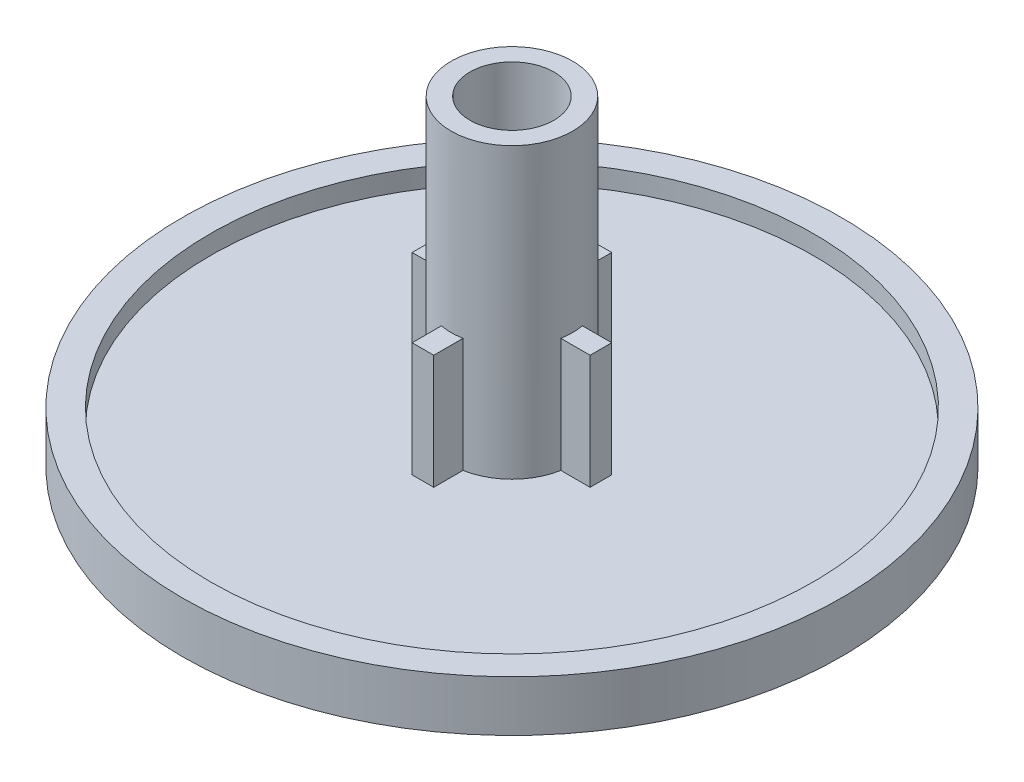
ISO-10303-21;
HEADER;
FILE_DESCRIPTION(('STEP AP214'),'2;1');
FILE_NAME('part.step','',(''),(''),'','','');
FILE_SCHEMA(('AUTOMOTIVE_DESIGN { 1 0 10303 214 1 1 1 1 }'));
ENDSEC;
DATA;
#1=APPLICATION_CONTEXT('core data for automotive mechanical design processes');
#2=APPLICATION_PROTOCOL_DEFINITION('international standard','automotive_design',2000,#1);
#3=PRODUCT_CONTEXT('',#1,'mechanical');
#4=PRODUCT('Part','Part','',(#3));
#5=PRODUCT_RELATED_PRODUCT_CATEGORY('part','',(#4));
#6=PRODUCT_DEFINITION_FORMATION('','',#4);
#7=PRODUCT_DEFINITION_CONTEXT('part definition',#1,'design');
#8=PRODUCT_DEFINITION('design','',#6,#7);
#9=PRODUCT_DEFINITION_SHAPE('','',#8);
#10=(LENGTH_UNIT() NAMED_UNIT(*) SI_UNIT(.MILLI.,.METRE.));
#11=(NAMED_UNIT(*) PLANE_ANGLE_UNIT() SI_UNIT($,.RADIAN.));
#12=(NAMED_UNIT(*) SI_UNIT($,.STERADIAN.) SOLID_ANGLE_UNIT());
#13=UNCERTAINTY_MEASURE_WITH_UNIT(LENGTH_MEASURE(1.E-05),#10,'distance_accuracy_value','');
#14=(GEOMETRIC_REPRESENTATION_CONTEXT(3) GLOBAL_UNCERTAINTY_ASSIGNED_CONTEXT((#13)) GLOBAL_UNIT_ASSIGNED_CONTEXT((#10,
#11,#12)) REPRESENTATION_CONTEXT('',''));
#15=CARTESIAN_POINT('',(0.,0.,0.));
#16=DIRECTION('',(0.,0.,1.));
#17=DIRECTION('',(1.,0.,0.));
#18=AXIS2_PLACEMENT_3D('',#15,#16,#17);
#19=CARTESIAN_POINT('',(0.,1.27,0.));
#20=DIRECTION('',(0.,1.,0.));
#21=DIRECTION('',(0.,0.,1.));
#22=AXIS2_PLACEMENT_3D('',#19,#20,#21);
#23=PLANE('',#22);
#24=CARTESIAN_POINT('',(0.,1.27,0.));
#25=DIRECTION('',(0.,1.,0.));
#26=DIRECTION('',(0.,0.,1.));
#27=AXIS2_PLACEMENT_3D('',#24,#25,#26);
#28=CIRCLE('',#27,12.0523);
#29=CARTESIAN_POINT('',(0.,1.27,12.0523));
#30=VERTEX_POINT('',#29);
#31=EDGE_CURVE('E265',#30,#30,#28,.F.);
#32=ORIENTED_EDGE('',*,*,#31,.F.);
#33=EDGE_LOOP('',(#32));
#34=FACE_BOUND('',#33,.T.);
#35=DIRECTION('',(1.,0.,0.));
#36=VECTOR('',#35,1.);
#37=CARTESIAN_POINT('',(0.,1.27,-3.556));
#38=LINE('',#37,#36);
#39=CARTESIAN_POINT('',(-0.4318,1.27,-3.556));
#40=VERTEX_POINT('',#39);
#41=CARTESIAN_POINT('',(0.4318,1.27,-3.556));
#42=VERTEX_POINT('',#41);
#43=EDGE_CURVE('E211',#40,#42,#38,.T.);
#44=ORIENTED_EDGE('',*,*,#43,.T.);
#45=DIRECTION('',(0.,0.,1.));
#46=VECTOR('',#45,1.);
#47=CARTESIAN_POINT('',(0.4318,1.27,0.));
#48=LINE('',#47,#46);
#49=CARTESIAN_POINT('',(0.4318,1.27,-2.38695815840999));
#50=VERTEX_POINT('',#49);
#51=EDGE_CURVE('E168',#42,#50,#48,.T.);
#52=ORIENTED_EDGE('',*,*,#51,.T.);
#53=CARTESIAN_POINT('',(0.,1.27,0.));
#54=DIRECTION('',(0.,1.,0.));
#55=DIRECTION('',(0.,0.,1.));
#56=AXIS2_PLACEMENT_3D('',#53,#54,#55);
#57=CIRCLE('',#56,2.4257);
#58=CARTESIAN_POINT('',(2.38695815840999,1.27,-0.4318));
#59=VERTEX_POINT('',#58);
#60=EDGE_CURVE('E251',#59,#50,#57,.T.);
#61=ORIENTED_EDGE('',*,*,#60,.F.);
#62=DIRECTION('',(-1.,0.,0.));
#63=VECTOR('',#62,1.);
#64=CARTESIAN_POINT('',(0.,1.27,-0.4318));
#65=LINE('',#64,#63);
#66=CARTESIAN_POINT('',(3.556,1.27,-0.4318));
#67=VERTEX_POINT('',#66);
#68=EDGE_CURVE('E242',#67,#59,#65,.T.);
#69=ORIENTED_EDGE('',*,*,#68,.F.);
#70=DIRECTION('',(0.,0.,1.));
#71=VECTOR('',#70,1.);
#72=CARTESIAN_POINT('',(3.556,1.27,0.));
#73=LINE('',#72,#71);
#74=CARTESIAN_POINT('',(3.556,1.27,0.4318));
#75=VERTEX_POINT('',#74);
#76=EDGE_CURVE('E285',#67,#75,#73,.T.);
#77=ORIENTED_EDGE('',*,*,#76,.T.);
#78=DIRECTION('',(-1.,0.,0.));
#79=VECTOR('',#78,1.);
#80=CARTESIAN_POINT('',(0.,1.27,0.4318));
#81=LINE('',#80,#79);
#82=CARTESIAN_POINT('',(2.38695815840999,1.27,0.4318));
#83=VERTEX_POINT('',#82);
#84=EDGE_CURVE('E246',#75,#83,#81,.T.);
#85=ORIENTED_EDGE('',*,*,#84,.T.);
#86=CARTESIAN_POINT('',(0.4318,1.27,2.38695815840999));
#87=VERTEX_POINT('',#86);
#88=EDGE_CURVE('E256',#87,#83,#57,.T.);
#89=ORIENTED_EDGE('',*,*,#88,.F.);
#90=CARTESIAN_POINT('',(0.4318,1.27,3.556));
#91=VERTEX_POINT('',#90);
#92=EDGE_CURVE('E206',#87,#91,#48,.T.);
#93=ORIENTED_EDGE('',*,*,#92,.T.);
#94=DIRECTION('',(-1.,0.,0.));
#95=VECTOR('',#94,1.);
#96=CARTESIAN_POINT('',(0.,1.27,3.556));
#97=LINE('',#96,#95);
#98=CARTESIAN_POINT('',(-0.4318,1.27,3.556));
#99=VERTEX_POINT('',#98);
#100=EDGE_CURVE('E213',#91,#99,#97,.T.);
#101=ORIENTED_EDGE('',*,*,#100,.T.);
#102=DIRECTION('',(0.,0.,1.));
#103=VECTOR('',#102,1.);
#104=CARTESIAN_POINT('',(-0.4318,1.27,0.));
#105=LINE('',#104,#103);
#106=CARTESIAN_POINT('',(-0.4318,1.27,2.38695815840999));
#107=VERTEX_POINT('',#106);
#108=EDGE_CURVE('E200',#107,#99,#105,.T.);
#109=ORIENTED_EDGE('',*,*,#108,.F.);
#110=CARTESIAN_POINT('',(-2.38695815840999,1.27,0.4318));
#111=VERTEX_POINT('',#110);
#112=EDGE_CURVE('E252',#111,#107,#57,.T.);
#113=ORIENTED_EDGE('',*,*,#112,.F.);
#114=CARTESIAN_POINT('',(-3.556,1.27,0.4318));
#115=VERTEX_POINT('',#114);
#116=EDGE_CURVE('E243',#111,#115,#81,.T.);
#117=ORIENTED_EDGE('',*,*,#116,.T.);
#118=DIRECTION('',(0.,0.,-1.));
#119=VECTOR('',#118,1.);
#120=CARTESIAN_POINT('',(-3.556,1.27,0.));
#121=LINE('',#120,#119);
#122=CARTESIAN_POINT('',(-3.556,1.27,-0.4318));
#123=VERTEX_POINT('',#122);
#124=EDGE_CURVE('E283',#115,#123,#121,.T.);
#125=ORIENTED_EDGE('',*,*,#124,.T.);
#126=CARTESIAN_POINT('',(-2.38695815840999,1.27,-0.4318));
#127=VERTEX_POINT('',#126);
#128=EDGE_CURVE('E240',#127,#123,#65,.T.);
#129=ORIENTED_EDGE('',*,*,#128,.F.);
#130=CARTESIAN_POINT('',(-0.4318,1.27,-2.38695815840999));
#131=VERTEX_POINT('',#130);
#132=EDGE_CURVE('E255',#131,#127,#57,.T.);
#133=ORIENTED_EDGE('',*,*,#132,.F.);
#134=EDGE_CURVE('E71',#40,#131,#105,.T.);
#135=ORIENTED_EDGE('',*,*,#134,.F.);
#136=EDGE_LOOP('',(#44,#52,#61,#69,#77,#85,#89,#93,#101,#109,#113,#117,#125,#129,#133,#135));
#137=FACE_BOUND('',#136,.T.);
#138=ADVANCED_FACE('F48',(#34,#137),#23,.T.);
#139=CARTESIAN_POINT('',(0.,12.8143,0.));
#140=DIRECTION('',(0.,-1.,0.));
#141=DIRECTION('',(0.,0.,-1.));
#142=AXIS2_PLACEMENT_3D('',#139,#140,#141);
#143=CYLINDRICAL_SURFACE('',#142,2.4257);
#144=CARTESIAN_POINT('',(0.,12.8143,0.));
#145=DIRECTION('',(0.,1.,0.));
#146=DIRECTION('',(0.,0.,1.));
#147=AXIS2_PLACEMENT_3D('',#144,#145,#146);
#148=CIRCLE('',#147,2.4257);
#149=CARTESIAN_POINT('',(0.,12.8143,2.4257));
#150=VERTEX_POINT('',#149);
#151=EDGE_CURVE('E247',#150,#150,#148,.T.);
#152=ORIENTED_EDGE('',*,*,#151,.F.);
#153=EDGE_LOOP('',(#152));
#154=FACE_BOUND('',#153,.T.);
#155=DIRECTION('',(0.,-1.,0.));
#156=VECTOR('',#155,1.);
#157=CARTESIAN_POINT('',(0.4318,12.8143,-2.38695815840999));
#158=LINE('',#157,#156);
#159=CARTESIAN_POINT('',(0.4318,5.842,-2.38695815840999));
#160=VERTEX_POINT('',#159);
#161=EDGE_CURVE('E209',#160,#50,#158,.T.);
#162=ORIENTED_EDGE('',*,*,#161,.F.);
#163=CARTESIAN_POINT('',(0.,5.842,0.));
#164=DIRECTION('',(0.,-1.,0.));
#165=DIRECTION('',(0.,0.,-1.));
#166=AXIS2_PLACEMENT_3D('',#163,#164,#165);
#167=CIRCLE('',#166,2.4257);
#168=CARTESIAN_POINT('',(-0.4318,5.842,-2.38695815840999));
#169=VERTEX_POINT('',#168);
#170=EDGE_CURVE('E13',#169,#160,#167,.T.);
#171=ORIENTED_EDGE('',*,*,#170,.F.);
#172=DIRECTION('',(0.,-1.,0.));
#173=VECTOR('',#172,1.);
#174=CARTESIAN_POINT('',(-0.4318,12.8143,-2.38695815840999));
#175=LINE('',#174,#173);
#176=EDGE_CURVE('E202',#169,#131,#175,.T.);
#177=ORIENTED_EDGE('',*,*,#176,.T.);
#178=ORIENTED_EDGE('',*,*,#132,.T.);
#179=DIRECTION('',(0.,-1.,0.));
#180=VECTOR('',#179,1.);
#181=CARTESIAN_POINT('',(-2.38695815840999,12.8143,-0.4318));
#182=LINE('',#181,#180);
#183=CARTESIAN_POINT('',(-2.38695815840999,5.842,-0.4318));
#184=VERTEX_POINT('',#183);
#185=EDGE_CURVE('E268',#127,#184,#182,.F.);
#186=ORIENTED_EDGE('',*,*,#185,.T.);
#187=CARTESIAN_POINT('',(0.,5.842,0.));
#188=DIRECTION('',(0.,-1.,0.));
#189=DIRECTION('',(0.,0.,-1.));
#190=AXIS2_PLACEMENT_3D('',#187,#188,#189);
#191=CIRCLE('',#190,2.4257);
#192=CARTESIAN_POINT('',(-2.38695815840999,5.842,0.4318));
#193=VERTEX_POINT('',#192);
#194=EDGE_CURVE('E271',#193,#184,#191,.T.);
#195=ORIENTED_EDGE('',*,*,#194,.F.);
#196=DIRECTION('',(0.,-1.,0.));
#197=VECTOR('',#196,1.);
#198=CARTESIAN_POINT('',(-2.38695815840999,12.8143,0.4318));
#199=LINE('',#198,#197);
#200=EDGE_CURVE('E274',#111,#193,#199,.F.);
#201=ORIENTED_EDGE('',*,*,#200,.F.);
#202=ORIENTED_EDGE('',*,*,#112,.T.);
#203=DIRECTION('',(0.,-1.,0.));
#204=VECTOR('',#203,1.);
#205=CARTESIAN_POINT('',(-0.4318,12.8143,2.38695815840999));
#206=LINE('',#205,#204);
#207=CARTESIAN_POINT('',(-0.4318,5.842,2.38695815840999));
#208=VERTEX_POINT('',#207);
#209=EDGE_CURVE('E181',#107,#208,#206,.F.);
#210=ORIENTED_EDGE('',*,*,#209,.T.);
#211=CARTESIAN_POINT('',(0.4318,5.842,2.38695815840999));
#212=VERTEX_POINT('',#211);
#213=EDGE_CURVE('E52',#212,#208,#167,.T.);
#214=ORIENTED_EDGE('',*,*,#213,.F.);
#215=DIRECTION('',(0.,-1.,0.));
#216=VECTOR('',#215,1.);
#217=CARTESIAN_POINT('',(0.4318,12.8143,2.38695815840999));
#218=LINE('',#217,#216);
#219=EDGE_CURVE('E204',#87,#212,#218,.F.);
#220=ORIENTED_EDGE('',*,*,#219,.F.);
#221=ORIENTED_EDGE('',*,*,#88,.T.);
#222=DIRECTION('',(0.,-1.,0.));
#223=VECTOR('',#222,1.);
#224=CARTESIAN_POINT('',(2.38695815840999,12.8143,0.4318));
#225=LINE('',#224,#223);
#226=CARTESIAN_POINT('',(2.38695815840999,5.842,0.4318));
#227=VERTEX_POINT('',#226);
#228=EDGE_CURVE('E280',#227,#83,#225,.T.);
#229=ORIENTED_EDGE('',*,*,#228,.F.);
#230=CARTESIAN_POINT('',(2.38695815840999,5.842,-0.4318));
#231=VERTEX_POINT('',#230);
#232=EDGE_CURVE('E275',#231,#227,#191,.T.);
#233=ORIENTED_EDGE('',*,*,#232,.F.);
#234=DIRECTION('',(0.,-1.,0.));
#235=VECTOR('',#234,1.);
#236=CARTESIAN_POINT('',(2.38695815840999,12.8143,-0.4318));
#237=LINE('',#236,#235);
#238=EDGE_CURVE('E277',#231,#59,#237,.T.);
#239=ORIENTED_EDGE('',*,*,#238,.T.);
#240=ORIENTED_EDGE('',*,*,#60,.T.);
#241=EDGE_LOOP('',(#162,#171,#177,#178,#186,#195,#201,#202,#210,#214,#220,#221,#229,#233,#239,#240));
#242=FACE_BOUND('',#241,.T.);
#243=ADVANCED_FACE('F297',(#154,#242),#143,.T.);
#244=CARTESIAN_POINT('',(0.,1.27,0.));
#245=DIRECTION('',(0.,-1.,0.));
#246=DIRECTION('',(0.,0.,-1.));
#247=AXIS2_PLACEMENT_3D('',#244,#245,#246);
#248=CYLINDRICAL_SURFACE('',#247,13.1699);
#249=CARTESIAN_POINT('',(0.,0.,0.));
#250=DIRECTION('',(0.,1.,0.));
#251=DIRECTION('',(0.,0.,1.));
#252=AXIS2_PLACEMENT_3D('',#249,#250,#251);
#253=CIRCLE('',#252,13.1699);
#254=CARTESIAN_POINT('',(0.,0.,13.1699));
#255=VERTEX_POINT('',#254);
#256=EDGE_CURVE('E262',#255,#255,#253,.T.);
#257=ORIENTED_EDGE('',*,*,#256,.T.);
#258=EDGE_LOOP('',(#257));
#259=FACE_BOUND('',#258,.T.);
#260=CARTESIAN_POINT('',(0.,2.032,0.));
#261=DIRECTION('',(0.,1.,0.));
#262=DIRECTION('',(0.,0.,1.));
#263=AXIS2_PLACEMENT_3D('',#260,#261,#262);
#264=CIRCLE('',#263,13.1699);
#265=CARTESIAN_POINT('',(0.,2.032,13.1699));
#266=VERTEX_POINT('',#265);
#267=EDGE_CURVE('E259',#266,#266,#264,.T.);
#268=ORIENTED_EDGE('',*,*,#267,.F.);
#269=EDGE_LOOP('',(#268));
#270=FACE_BOUND('',#269,.T.);
#271=ADVANCED_FACE('F50',(#259,#270),#248,.T.);
#272=CARTESIAN_POINT('',(0.,0.,0.));
#273=DIRECTION('',(0.,1.,0.));
#274=DIRECTION('',(0.,0.,1.));
#275=AXIS2_PLACEMENT_3D('',#272,#273,#274);
#276=PLANE('',#275);
#277=ORIENTED_EDGE('',*,*,#256,.F.);
#278=EDGE_LOOP('',(#277));
#279=FACE_BOUND('',#278,.T.);
#280=ADVANCED_FACE('F332',(#279),#276,.F.);
#281=CARTESIAN_POINT('',(0.,2.032,0.));
#282=DIRECTION('',(0.,1.,0.));
#283=DIRECTION('',(0.,0.,1.));
#284=AXIS2_PLACEMENT_3D('',#281,#282,#283);
#285=PLANE('',#284);
#286=ORIENTED_EDGE('',*,*,#267,.T.);
#287=EDGE_LOOP('',(#286));
#288=FACE_BOUND('',#287,.T.);
#289=CARTESIAN_POINT('',(0.,2.032,0.));
#290=DIRECTION('',(0.,1.,0.));
#291=DIRECTION('',(0.,0.,1.));
#292=AXIS2_PLACEMENT_3D('',#289,#290,#291);
#293=CIRCLE('',#292,12.0523);
#294=CARTESIAN_POINT('',(0.,2.032,12.0523));
#295=VERTEX_POINT('',#294);
#296=EDGE_CURVE('E250',#295,#295,#293,.T.);
#297=ORIENTED_EDGE('',*,*,#296,.F.);
#298=EDGE_LOOP('',(#297));
#299=FACE_BOUND('',#298,.T.);
#300=ADVANCED_FACE('F340',(#288,#299),#285,.T.);
#301=CARTESIAN_POINT('',(0.,2.032,0.));
#302=DIRECTION('',(0.,-1.,0.));
#303=DIRECTION('',(0.,0.,-1.));
#304=AXIS2_PLACEMENT_3D('',#301,#302,#303);
#305=CYLINDRICAL_SURFACE('',#304,12.0523);
#306=ORIENTED_EDGE('',*,*,#296,.T.);
#307=EDGE_LOOP('',(#306));
#308=FACE_BOUND('',#307,.T.);
#309=ORIENTED_EDGE('',*,*,#31,.T.);
#310=EDGE_LOOP('',(#309));
#311=FACE_BOUND('',#310,.T.);
#312=ADVANCED_FACE('F322',(#308,#311),#305,.F.);
#313=CARTESIAN_POINT('',(0.,12.8143,0.));
#314=DIRECTION('',(0.,1.,0.));
#315=DIRECTION('',(0.,0.,1.));
#316=AXIS2_PLACEMENT_3D('',#313,#314,#315);
#317=PLANE('',#316);
#318=CARTESIAN_POINT('',(0.,12.8143,0.));
#319=DIRECTION('',(0.,1.,0.));
#320=DIRECTION('',(0.,0.,1.));
#321=AXIS2_PLACEMENT_3D('',#318,#319,#320);
#322=CIRCLE('',#321,1.6764);
#323=CARTESIAN_POINT('',(0.,12.8143,1.6764));
#324=VERTEX_POINT('',#323);
#325=EDGE_CURVE('E312',#324,#324,#322,.T.);
#326=ORIENTED_EDGE('',*,*,#325,.F.);
#327=EDGE_LOOP('',(#326));
#328=FACE_BOUND('',#327,.T.);
#329=ORIENTED_EDGE('',*,*,#151,.T.);
#330=EDGE_LOOP('',(#329));
#331=FACE_BOUND('',#330,.T.);
#332=ADVANCED_FACE('F318',(#328,#331),#317,.T.);
#333=CARTESIAN_POINT('',(0.,0.,-0.4318));
#334=DIRECTION('',(0.,0.,-1.));
#335=DIRECTION('',(-1.,0.,0.));
#336=AXIS2_PLACEMENT_3D('',#333,#334,#335);
#337=PLANE('',#336);
#338=ORIENTED_EDGE('',*,*,#185,.F.);
#339=ORIENTED_EDGE('',*,*,#128,.T.);
#340=DIRECTION('',(0.,-1.,0.));
#341=VECTOR('',#340,1.);
#342=CARTESIAN_POINT('',(-3.556,0.,-0.4318));
#343=LINE('',#342,#341);
#344=CARTESIAN_POINT('',(-3.556,5.842,-0.4318));
#345=VERTEX_POINT('',#344);
#346=EDGE_CURVE('E216',#345,#123,#343,.T.);
#347=ORIENTED_EDGE('',*,*,#346,.F.);
#348=DIRECTION('',(-1.,0.,0.));
#349=VECTOR('',#348,1.);
#350=CARTESIAN_POINT('',(-3.556,5.842,-0.4318));
#351=LINE('',#350,#349);
#352=EDGE_CURVE('E232',#184,#345,#351,.T.);
#353=ORIENTED_EDGE('',*,*,#352,.F.);
#354=EDGE_LOOP('',(#338,#339,#347,#353));
#355=FACE_BOUND('',#354,.T.);
#356=ADVANCED_FACE('F321',(#355),#337,.T.);
#357=CARTESIAN_POINT('',(0.,0.,0.4318));
#358=DIRECTION('',(0.,0.,-1.));
#359=DIRECTION('',(-1.,0.,0.));
#360=AXIS2_PLACEMENT_3D('',#357,#358,#359);
#361=PLANE('',#360);
#362=ORIENTED_EDGE('',*,*,#116,.F.);
#363=ORIENTED_EDGE('',*,*,#200,.T.);
#364=DIRECTION('',(-1.,0.,0.));
#365=VECTOR('',#364,1.);
#366=CARTESIAN_POINT('',(-3.556,5.842,0.4318));
#367=LINE('',#366,#365);
#368=CARTESIAN_POINT('',(-3.556,5.842,0.4318));
#369=VERTEX_POINT('',#368);
#370=EDGE_CURVE('E223',#193,#369,#367,.T.);
#371=ORIENTED_EDGE('',*,*,#370,.T.);
#372=DIRECTION('',(0.,-1.,0.));
#373=VECTOR('',#372,1.);
#374=CARTESIAN_POINT('',(-3.556,0.,0.4318));
#375=LINE('',#374,#373);
#376=EDGE_CURVE('E217',#369,#115,#375,.T.);
#377=ORIENTED_EDGE('',*,*,#376,.T.);
#378=EDGE_LOOP('',(#362,#363,#371,#377));
#379=FACE_BOUND('',#378,.T.);
#380=ADVANCED_FACE('F378',(#379),#361,.F.);
#381=CARTESIAN_POINT('',(-3.556,5.842,0.4318));
#382=DIRECTION('',(0.,-1.,0.));
#383=DIRECTION('',(0.,0.,-1.));
#384=AXIS2_PLACEMENT_3D('',#381,#382,#383);
#385=PLANE('',#384);
#386=ORIENTED_EDGE('',*,*,#370,.F.);
#387=ORIENTED_EDGE('',*,*,#194,.T.);
#388=ORIENTED_EDGE('',*,*,#352,.T.);
#389=DIRECTION('',(0.,0.,-1.));
#390=VECTOR('',#389,1.);
#391=CARTESIAN_POINT('',(-3.556,5.842,0.4318));
#392=LINE('',#391,#390);
#393=EDGE_CURVE('E227',#369,#345,#392,.T.);
#394=ORIENTED_EDGE('',*,*,#393,.F.);
#395=EDGE_LOOP('',(#386,#387,#388,#394));
#396=FACE_BOUND('',#395,.T.);
#397=ADVANCED_FACE('F387',(#396),#385,.F.);
#398=CARTESIAN_POINT('',(-3.556,0.,0.4318));
#399=DIRECTION('',(1.,0.,0.));
#400=DIRECTION('',(0.,0.,-1.));
#401=AXIS2_PLACEMENT_3D('',#398,#399,#400);
#402=PLANE('',#401);
#403=ORIENTED_EDGE('',*,*,#124,.F.);
#404=ORIENTED_EDGE('',*,*,#376,.F.);
#405=ORIENTED_EDGE('',*,*,#393,.T.);
#406=ORIENTED_EDGE('',*,*,#346,.T.);
#407=EDGE_LOOP('',(#403,#404,#405,#406));
#408=FACE_BOUND('',#407,.T.);
#409=ADVANCED_FACE('F396',(#408),#402,.F.);
#410=CARTESIAN_POINT('',(3.556,5.842,-0.4318));
#411=VERTEX_POINT('',#410);
#412=EDGE_CURVE('E221',#411,#231,#351,.T.);
#413=ORIENTED_EDGE('',*,*,#412,.T.);
#414=ORIENTED_EDGE('',*,*,#232,.T.);
#415=CARTESIAN_POINT('',(3.556,5.842,0.4318));
#416=VERTEX_POINT('',#415);
#417=EDGE_CURVE('E224',#416,#227,#367,.T.);
#418=ORIENTED_EDGE('',*,*,#417,.F.);
#419=DIRECTION('',(0.,0.,-1.));
#420=VECTOR('',#419,1.);
#421=CARTESIAN_POINT('',(3.556,5.842,0.4318));
#422=LINE('',#421,#420);
#423=EDGE_CURVE('E237',#416,#411,#422,.T.);
#424=ORIENTED_EDGE('',*,*,#423,.T.);
#425=EDGE_LOOP('',(#413,#414,#418,#424));
#426=FACE_BOUND('',#425,.T.);
#427=ADVANCED_FACE('F399',(#426),#385,.F.);
#428=ORIENTED_EDGE('',*,*,#84,.F.);
#429=DIRECTION('',(0.,1.,0.));
#430=VECTOR('',#429,1.);
#431=CARTESIAN_POINT('',(3.556,0.,0.4318));
#432=LINE('',#431,#430);
#433=EDGE_CURVE('E220',#75,#416,#432,.T.);
#434=ORIENTED_EDGE('',*,*,#433,.T.);
#435=ORIENTED_EDGE('',*,*,#417,.T.);
#436=ORIENTED_EDGE('',*,*,#228,.T.);
#437=EDGE_LOOP('',(#428,#434,#435,#436));
#438=FACE_BOUND('',#437,.T.);
#439=ADVANCED_FACE('F390',(#438),#361,.F.);
#440=DIRECTION('',(0.,1.,0.));
#441=VECTOR('',#440,1.);
#442=CARTESIAN_POINT('',(3.556,0.,-0.4318));
#443=LINE('',#442,#441);
#444=EDGE_CURVE('E230',#67,#411,#443,.T.);
#445=ORIENTED_EDGE('',*,*,#444,.F.);
#446=ORIENTED_EDGE('',*,*,#68,.T.);
#447=ORIENTED_EDGE('',*,*,#238,.F.);
#448=ORIENTED_EDGE('',*,*,#412,.F.);
#449=EDGE_LOOP('',(#445,#446,#447,#448));
#450=FACE_BOUND('',#449,.T.);
#451=ADVANCED_FACE('F381',(#450),#337,.T.);
#452=CARTESIAN_POINT('',(3.556,0.,0.4318));
#453=DIRECTION('',(-1.,0.,0.));
#454=DIRECTION('',(0.,0.,1.));
#455=AXIS2_PLACEMENT_3D('',#452,#453,#454);
#456=PLANE('',#455);
#457=ORIENTED_EDGE('',*,*,#76,.F.);
#458=ORIENTED_EDGE('',*,*,#444,.T.);
#459=ORIENTED_EDGE('',*,*,#423,.F.);
#460=ORIENTED_EDGE('',*,*,#433,.F.);
#461=EDGE_LOOP('',(#457,#458,#459,#460));
#462=FACE_BOUND('',#461,.T.);
#463=ADVANCED_FACE('F423',(#462),#456,.F.);
#464=CARTESIAN_POINT('',(-0.4318,0.,0.));
#465=DIRECTION('',(-1.,0.,0.));
#466=DIRECTION('',(0.,0.,1.));
#467=AXIS2_PLACEMENT_3D('',#464,#465,#466);
#468=PLANE('',#467);
#469=ORIENTED_EDGE('',*,*,#209,.F.);
#470=ORIENTED_EDGE('',*,*,#108,.T.);
#471=DIRECTION('',(0.,-1.,0.));
#472=VECTOR('',#471,1.);
#473=CARTESIAN_POINT('',(-0.4318,0.,3.556));
#474=LINE('',#473,#472);
#475=CARTESIAN_POINT('',(-0.4318,5.842,3.556));
#476=VERTEX_POINT('',#475);
#477=EDGE_CURVE('E191',#476,#99,#474,.T.);
#478=ORIENTED_EDGE('',*,*,#477,.F.);
#479=DIRECTION('',(0.,0.,1.));
#480=VECTOR('',#479,1.);
#481=CARTESIAN_POINT('',(-0.4318,5.842,3.556));
#482=LINE('',#481,#480);
#483=EDGE_CURVE('E63',#208,#476,#482,.T.);
#484=ORIENTED_EDGE('',*,*,#483,.F.);
#485=EDGE_LOOP('',(#469,#470,#478,#484));
#486=FACE_BOUND('',#485,.T.);
#487=ADVANCED_FACE('F301',(#486),#468,.T.);
#488=CARTESIAN_POINT('',(0.4318,0.,0.));
#489=DIRECTION('',(-1.,0.,0.));
#490=DIRECTION('',(0.,0.,1.));
#491=AXIS2_PLACEMENT_3D('',#488,#489,#490);
#492=PLANE('',#491);
#493=ORIENTED_EDGE('',*,*,#92,.F.);
#494=ORIENTED_EDGE('',*,*,#219,.T.);
#495=DIRECTION('',(0.,0.,1.));
#496=VECTOR('',#495,1.);
#497=CARTESIAN_POINT('',(0.4318,5.842,3.556));
#498=LINE('',#497,#496);
#499=CARTESIAN_POINT('',(0.4318,5.842,3.556));
#500=VERTEX_POINT('',#499);
#501=EDGE_CURVE('E171',#212,#500,#498,.T.);
#502=ORIENTED_EDGE('',*,*,#501,.T.);
#503=DIRECTION('',(0.,-1.,0.));
#504=VECTOR('',#503,1.);
#505=CARTESIAN_POINT('',(0.4318,0.,3.556));
#506=LINE('',#505,#504);
#507=EDGE_CURVE('E172',#500,#91,#506,.T.);
#508=ORIENTED_EDGE('',*,*,#507,.T.);
#509=EDGE_LOOP('',(#493,#494,#502,#508));
#510=FACE_BOUND('',#509,.T.);
#511=ADVANCED_FACE('F308',(#510),#492,.F.);
#512=CARTESIAN_POINT('',(0.4318,5.842,3.556));
#513=DIRECTION('',(0.,-1.,0.));
#514=DIRECTION('',(0.,0.,-1.));
#515=AXIS2_PLACEMENT_3D('',#512,#513,#514);
#516=PLANE('',#515);
#517=ORIENTED_EDGE('',*,*,#501,.F.);
#518=ORIENTED_EDGE('',*,*,#213,.T.);
#519=ORIENTED_EDGE('',*,*,#483,.T.);
#520=DIRECTION('',(-1.,0.,0.));
#521=VECTOR('',#520,1.);
#522=CARTESIAN_POINT('',(0.4318,5.842,3.556));
#523=LINE('',#522,#521);
#524=EDGE_CURVE('E182',#500,#476,#523,.T.);
#525=ORIENTED_EDGE('',*,*,#524,.F.);
#526=EDGE_LOOP('',(#517,#518,#519,#525));
#527=FACE_BOUND('',#526,.T.);
#528=ADVANCED_FACE('F293',(#527),#516,.F.);
#529=CARTESIAN_POINT('',(0.4318,0.,3.556));
#530=DIRECTION('',(0.,0.,-1.));
#531=DIRECTION('',(-1.,0.,0.));
#532=AXIS2_PLACEMENT_3D('',#529,#530,#531);
#533=PLANE('',#532);
#534=ORIENTED_EDGE('',*,*,#100,.F.);
#535=ORIENTED_EDGE('',*,*,#507,.F.);
#536=ORIENTED_EDGE('',*,*,#524,.T.);
#537=ORIENTED_EDGE('',*,*,#477,.T.);
#538=EDGE_LOOP('',(#534,#535,#536,#537));
#539=FACE_BOUND('',#538,.T.);
#540=ADVANCED_FACE('F306',(#539),#533,.F.);
#541=ORIENTED_EDGE('',*,*,#51,.F.);
#542=DIRECTION('',(0.,1.,0.));
#543=VECTOR('',#542,1.);
#544=CARTESIAN_POINT('',(0.4318,0.,-3.556));
#545=LINE('',#544,#543);
#546=CARTESIAN_POINT('',(0.4318,5.842,-3.556));
#547=VERTEX_POINT('',#546);
#548=EDGE_CURVE('E161',#42,#547,#545,.T.);
#549=ORIENTED_EDGE('',*,*,#548,.T.);
#550=EDGE_CURVE('E165',#547,#160,#498,.T.);
#551=ORIENTED_EDGE('',*,*,#550,.T.);
#552=ORIENTED_EDGE('',*,*,#161,.T.);
#553=EDGE_LOOP('',(#541,#549,#551,#552));
#554=FACE_BOUND('',#553,.T.);
#555=ADVANCED_FACE('F163',(#554),#492,.F.);
#556=DIRECTION('',(0.,1.,0.));
#557=VECTOR('',#556,1.);
#558=CARTESIAN_POINT('',(-0.4318,0.,-3.556));
#559=LINE('',#558,#557);
#560=CARTESIAN_POINT('',(-0.4318,5.842,-3.556));
#561=VERTEX_POINT('',#560);
#562=EDGE_CURVE('E177',#40,#561,#559,.T.);
#563=ORIENTED_EDGE('',*,*,#562,.F.);
#564=ORIENTED_EDGE('',*,*,#134,.T.);
#565=ORIENTED_EDGE('',*,*,#176,.F.);
#566=EDGE_CURVE('E196',#561,#169,#482,.T.);
#567=ORIENTED_EDGE('',*,*,#566,.F.);
#568=EDGE_LOOP('',(#563,#564,#565,#567));
#569=FACE_BOUND('',#568,.T.);
#570=ADVANCED_FACE('F438',(#569),#468,.T.);
#571=CARTESIAN_POINT('',(0.4318,0.,-3.556));
#572=DIRECTION('',(0.,0.,1.));
#573=DIRECTION('',(1.,0.,0.));
#574=AXIS2_PLACEMENT_3D('',#571,#572,#573);
#575=PLANE('',#574);
#576=ORIENTED_EDGE('',*,*,#43,.F.);
#577=ORIENTED_EDGE('',*,*,#562,.T.);
#578=DIRECTION('',(-1.,0.,0.));
#579=VECTOR('',#578,1.);
#580=CARTESIAN_POINT('',(0.4318,5.842,-3.556));
#581=LINE('',#580,#579);
#582=EDGE_CURVE('E175',#547,#561,#581,.T.);
#583=ORIENTED_EDGE('',*,*,#582,.F.);
#584=ORIENTED_EDGE('',*,*,#548,.F.);
#585=EDGE_LOOP('',(#576,#577,#583,#584));
#586=FACE_BOUND('',#585,.T.);
#587=ADVANCED_FACE('F176',(#586),#575,.F.);
#588=ORIENTED_EDGE('',*,*,#566,.T.);
#589=ORIENTED_EDGE('',*,*,#170,.T.);
#590=ORIENTED_EDGE('',*,*,#550,.F.);
#591=ORIENTED_EDGE('',*,*,#582,.T.);
#592=EDGE_LOOP('',(#588,#589,#590,#591));
#593=FACE_BOUND('',#592,.T.);
#594=ADVANCED_FACE('F184',(#593),#516,.F.);
#595=CARTESIAN_POINT('',(0.,-3.47157523192451,0.));
#596=DIRECTION('',(0.,1.,0.));
#597=DIRECTION('',(0.,0.,1.));
#598=AXIS2_PLACEMENT_3D('',#595,#596,#597);
#599=CYLINDRICAL_SURFACE('',#598,1.6764);
#600=CARTESIAN_POINT('',(0.,1.27,0.));
#601=DIRECTION('',(0.,1.,0.));
#602=DIRECTION('',(0.,0.,1.));
#603=AXIS2_PLACEMENT_3D('',#600,#601,#602);
#604=CIRCLE('',#603,1.6764);
#605=CARTESIAN_POINT('',(0.,1.27,1.6764));
#606=VERTEX_POINT('',#605);
#607=EDGE_CURVE('E194',#606,#606,#604,.F.);
#608=ORIENTED_EDGE('',*,*,#607,.T.);
#609=EDGE_LOOP('',(#608));
#610=FACE_BOUND('',#609,.T.);
#611=ORIENTED_EDGE('',*,*,#325,.T.);
#612=EDGE_LOOP('',(#611));
#613=FACE_BOUND('',#612,.T.);
#614=ADVANCED_FACE('F316',(#610,#613),#599,.F.);
#615=CARTESIAN_POINT('',(0.,1.27,0.));
#616=DIRECTION('',(0.,1.,0.));
#617=DIRECTION('',(0.,0.,1.));
#618=AXIS2_PLACEMENT_3D('',#615,#616,#617);
#619=PLANE('',#618);
#620=ORIENTED_EDGE('',*,*,#607,.F.);
#621=EDGE_LOOP('',(#620));
#622=FACE_BOUND('',#621,.T.);
#623=ADVANCED_FACE('F481',(#622),#619,.T.);
#624=CLOSED_SHELL('',(#138,#243,#271,#280,#300,#312,#332,#356,#380,#397,#409,#427,#439,#451,
#463,#487,#511,#528,#540,#555,#570,#587,#594,#614,#623));
#625=MANIFOLD_SOLID_BREP('B2',#624);
#626=ADVANCED_BREP_SHAPE_REPRESENTATION('',(#18,#625),#14);
#627=SHAPE_DEFINITION_REPRESENTATION(#9,#626);
ENDSEC;
END-ISO-10303-21;
